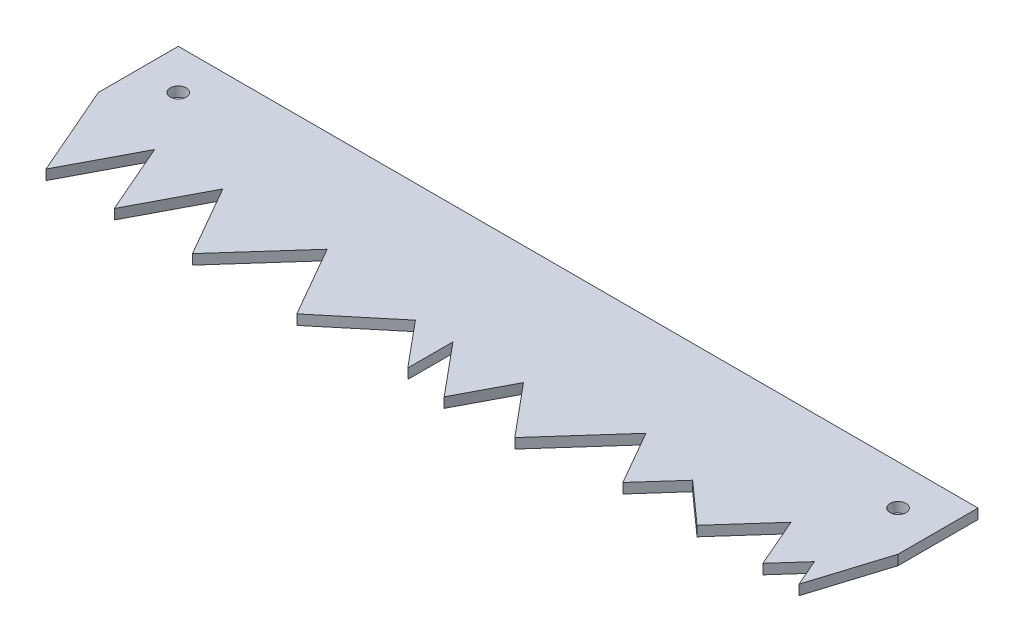
ISO-10303-21;
HEADER;
FILE_DESCRIPTION(('STEP AP214'),'2;1');
FILE_NAME('part.step','',(''),(''),'','','');
FILE_SCHEMA(('AUTOMOTIVE_DESIGN { 1 0 10303 214 1 1 1 1 }'));
ENDSEC;
DATA;
#1=APPLICATION_CONTEXT('core data for automotive mechanical design processes');
#2=APPLICATION_PROTOCOL_DEFINITION('international standard','automotive_design',2000,#1);
#3=PRODUCT_CONTEXT('',#1,'mechanical');
#4=PRODUCT('Part','Part','',(#3));
#5=PRODUCT_RELATED_PRODUCT_CATEGORY('part','',(#4));
#6=PRODUCT_DEFINITION_FORMATION('','',#4);
#7=PRODUCT_DEFINITION_CONTEXT('part definition',#1,'design');
#8=PRODUCT_DEFINITION('design','',#6,#7);
#9=PRODUCT_DEFINITION_SHAPE('','',#8);
#10=(LENGTH_UNIT() NAMED_UNIT(*) SI_UNIT(.MILLI.,.METRE.));
#11=(NAMED_UNIT(*) PLANE_ANGLE_UNIT() SI_UNIT($,.RADIAN.));
#12=(NAMED_UNIT(*) SI_UNIT($,.STERADIAN.) SOLID_ANGLE_UNIT());
#13=UNCERTAINTY_MEASURE_WITH_UNIT(LENGTH_MEASURE(1.E-05),#10,'distance_accuracy_value','');
#14=(GEOMETRIC_REPRESENTATION_CONTEXT(3) GLOBAL_UNCERTAINTY_ASSIGNED_CONTEXT((#13)) GLOBAL_UNIT_ASSIGNED_CONTEXT((#10,
#11,#12)) REPRESENTATION_CONTEXT('',''));
#15=CARTESIAN_POINT('',(0.,0.,0.));
#16=DIRECTION('',(0.,0.,1.));
#17=DIRECTION('',(1.,0.,0.));
#18=AXIS2_PLACEMENT_3D('',#15,#16,#17);
#19=CARTESIAN_POINT('',(-127.,3.175,-12.7));
#20=DIRECTION('',(1.,0.,0.));
#21=DIRECTION('',(0.,0.,-1.));
#22=AXIS2_PLACEMENT_3D('',#19,#20,#21);
#23=PLANE('',#22);
#24=DIRECTION('',(0.,0.,1.));
#25=VECTOR('',#24,1.);
#26=CARTESIAN_POINT('',(-127.,0.,-12.7));
#27=LINE('',#26,#25);
#28=CARTESIAN_POINT('',(-127.,0.,-12.7));
#29=VERTEX_POINT('',#28);
#30=CARTESIAN_POINT('',(-127.,0.,12.7));
#31=VERTEX_POINT('',#30);
#32=EDGE_CURVE('E211',#29,#31,#27,.T.);
#33=ORIENTED_EDGE('',*,*,#32,.T.);
#34=DIRECTION('',(0.,-1.,0.));
#35=VECTOR('',#34,1.);
#36=CARTESIAN_POINT('',(-127.,3.175,12.7));
#37=LINE('',#36,#35);
#38=CARTESIAN_POINT('',(-127.,3.175,12.7));
#39=VERTEX_POINT('',#38);
#40=EDGE_CURVE('E11',#39,#31,#37,.T.);
#41=ORIENTED_EDGE('',*,*,#40,.F.);
#42=DIRECTION('',(0.,0.,1.));
#43=VECTOR('',#42,1.);
#44=CARTESIAN_POINT('',(-127.,3.175,-12.7));
#45=LINE('',#44,#43);
#46=CARTESIAN_POINT('',(-127.,3.175,-12.7));
#47=VERTEX_POINT('',#46);
#48=EDGE_CURVE('E78',#47,#39,#45,.T.);
#49=ORIENTED_EDGE('',*,*,#48,.F.);
#50=DIRECTION('',(0.,-1.,0.));
#51=VECTOR('',#50,1.);
#52=CARTESIAN_POINT('',(-127.,3.175,-12.7));
#53=LINE('',#52,#51);
#54=EDGE_CURVE('E213',#47,#29,#53,.T.);
#55=ORIENTED_EDGE('',*,*,#54,.T.);
#56=EDGE_LOOP('',(#33,#41,#49,#55));
#57=FACE_BOUND('',#56,.T.);
#58=ADVANCED_FACE('F37',(#57),#23,.F.);
#59=CARTESIAN_POINT('',(127.,3.175,-12.7));
#60=DIRECTION('',(-1.,0.,0.));
#61=DIRECTION('',(0.,0.,1.));
#62=AXIS2_PLACEMENT_3D('',#59,#60,#61);
#63=PLANE('',#62);
#64=DIRECTION('',(0.,0.,-1.));
#65=VECTOR('',#64,1.);
#66=CARTESIAN_POINT('',(127.,0.,-12.7));
#67=LINE('',#66,#65);
#68=CARTESIAN_POINT('',(127.,0.,12.7));
#69=VERTEX_POINT('',#68);
#70=CARTESIAN_POINT('',(127.,0.,-12.7));
#71=VERTEX_POINT('',#70);
#72=EDGE_CURVE('E67',#69,#71,#67,.T.);
#73=ORIENTED_EDGE('',*,*,#72,.T.);
#74=DIRECTION('',(0.,-1.,0.));
#75=VECTOR('',#74,1.);
#76=CARTESIAN_POINT('',(127.,3.175,-12.7));
#77=LINE('',#76,#75);
#78=CARTESIAN_POINT('',(127.,3.175,-12.7));
#79=VERTEX_POINT('',#78);
#80=EDGE_CURVE('E407',#79,#71,#77,.T.);
#81=ORIENTED_EDGE('',*,*,#80,.F.);
#82=DIRECTION('',(0.,0.,-1.));
#83=VECTOR('',#82,1.);
#84=CARTESIAN_POINT('',(127.,3.175,-12.7));
#85=LINE('',#84,#83);
#86=CARTESIAN_POINT('',(127.,3.175,12.7));
#87=VERTEX_POINT('',#86);
#88=EDGE_CURVE('E401',#87,#79,#85,.T.);
#89=ORIENTED_EDGE('',*,*,#88,.F.);
#90=DIRECTION('',(0.,-1.,0.));
#91=VECTOR('',#90,1.);
#92=CARTESIAN_POINT('',(127.,3.175,12.7));
#93=LINE('',#92,#91);
#94=EDGE_CURVE('E45',#87,#69,#93,.T.);
#95=ORIENTED_EDGE('',*,*,#94,.T.);
#96=EDGE_LOOP('',(#73,#81,#89,#95));
#97=FACE_BOUND('',#96,.T.);
#98=ADVANCED_FACE('F409',(#97),#63,.F.);
#99=CARTESIAN_POINT('',(-127.,3.175,-12.7));
#100=DIRECTION('',(0.,0.,1.));
#101=DIRECTION('',(1.,0.,0.));
#102=AXIS2_PLACEMENT_3D('',#99,#100,#101);
#103=PLANE('',#102);
#104=DIRECTION('',(-1.,0.,0.));
#105=VECTOR('',#104,1.);
#106=CARTESIAN_POINT('',(-127.,0.,-12.7));
#107=LINE('',#106,#105);
#108=EDGE_CURVE('E73',#71,#29,#107,.T.);
#109=ORIENTED_EDGE('',*,*,#108,.T.);
#110=ORIENTED_EDGE('',*,*,#54,.F.);
#111=DIRECTION('',(-1.,0.,0.));
#112=VECTOR('',#111,1.);
#113=CARTESIAN_POINT('',(-127.,3.175,-12.7));
#114=LINE('',#113,#112);
#115=EDGE_CURVE('E53',#79,#47,#114,.T.);
#116=ORIENTED_EDGE('',*,*,#115,.F.);
#117=ORIENTED_EDGE('',*,*,#80,.T.);
#118=EDGE_LOOP('',(#109,#110,#116,#117));
#119=FACE_BOUND('',#118,.T.);
#120=ADVANCED_FACE('F494',(#119),#103,.F.);
#121=CARTESIAN_POINT('',(0.,3.175,0.));
#122=DIRECTION('',(0.,1.,0.));
#123=DIRECTION('',(0.,0.,1.));
#124=AXIS2_PLACEMENT_3D('',#121,#122,#123);
#125=PLANE('',#124);
#126=CARTESIAN_POINT('',(-114.3,3.175,0.));
#127=DIRECTION('',(0.,1.,0.));
#128=DIRECTION('',(0.,0.,1.));
#129=AXIS2_PLACEMENT_3D('',#126,#127,#128);
#130=CIRCLE('',#129,2.54);
#131=CARTESIAN_POINT('',(-114.3,3.175,2.54));
#132=VERTEX_POINT('',#131);
#133=EDGE_CURVE('E800',#132,#132,#130,.T.);
#134=ORIENTED_EDGE('',*,*,#133,.F.);
#135=EDGE_LOOP('',(#134));
#136=FACE_BOUND('',#135,.T.);
#137=CARTESIAN_POINT('',(114.3,3.175,0.));
#138=DIRECTION('',(0.,1.,0.));
#139=DIRECTION('',(0.,0.,1.));
#140=AXIS2_PLACEMENT_3D('',#137,#138,#139);
#141=CIRCLE('',#140,2.54);
#142=CARTESIAN_POINT('',(114.3,3.175,2.54));
#143=VERTEX_POINT('',#142);
#144=EDGE_CURVE('E801',#143,#143,#141,.T.);
#145=ORIENTED_EDGE('',*,*,#144,.F.);
#146=EDGE_LOOP('',(#145));
#147=FACE_BOUND('',#146,.T.);
#148=ORIENTED_EDGE('',*,*,#48,.T.);
#149=DIRECTION('',(0.398315927740006,0.,0.917248287928966));
#150=VECTOR('',#149,1.);
#151=CARTESIAN_POINT('',(-127.,3.175,12.7));
#152=LINE('',#151,#150);
#153=CARTESIAN_POINT('',(-114.245058960455,3.175,42.072282192024));
#154=VERTEX_POINT('',#153);
#155=EDGE_CURVE('E222',#39,#154,#152,.T.);
#156=ORIENTED_EDGE('',*,*,#155,.T.);
#157=DIRECTION('',(0.464759216041281,0.,-0.885437107368273));
#158=VECTOR('',#157,1.);
#159=CARTESIAN_POINT('',(-114.245058960455,3.175,42.072282192024));
#160=LINE('',#159,#158);
#161=CARTESIAN_POINT('',(-102.377802861673,3.175,19.4633514816094));
#162=VERTEX_POINT('',#161);
#163=EDGE_CURVE('E300',#154,#162,#160,.T.);
#164=ORIENTED_EDGE('',*,*,#163,.T.);
#165=DIRECTION('',(0.398315927740006,0.,0.917248287928965));
#166=VECTOR('',#165,1.);
#167=CARTESIAN_POINT('',(-102.377802861673,3.175,19.4633514816094));
#168=LINE('',#167,#166);
#169=CARTESIAN_POINT('',(-92.5598535347124,3.175,42.072282192024));
#170=VERTEX_POINT('',#169);
#171=EDGE_CURVE('E304',#162,#170,#168,.T.);
#172=ORIENTED_EDGE('',*,*,#171,.T.);
#173=DIRECTION('',(0.464759216041281,0.,-0.885437107368273));
#174=VECTOR('',#173,1.);
#175=CARTESIAN_POINT('',(-92.5598535347124,3.175,42.072282192024));
#176=LINE('',#175,#174);
#177=CARTESIAN_POINT('',(-80.6925974359306,3.175,19.4633514816094));
#178=VERTEX_POINT('',#177);
#179=EDGE_CURVE('E307',#170,#178,#176,.T.);
#180=ORIENTED_EDGE('',*,*,#179,.T.);
#181=DIRECTION('',(0.497500509024724,0.,0.867463684265883));
#182=VECTOR('',#181,1.);
#183=CARTESIAN_POINT('',(-80.6925974359306,3.175,19.4633514816094));
#184=LINE('',#183,#182);
#185=CARTESIAN_POINT('',(-67.7261127969167,3.175,42.072282192024));
#186=VERTEX_POINT('',#185);
#187=EDGE_CURVE('E310',#178,#186,#184,.T.);
#188=ORIENTED_EDGE('',*,*,#187,.T.);
#189=DIRECTION('',(0.665914196239404,0.,-0.74602833943948));
#190=VECTOR('',#189,1.);
#191=CARTESIAN_POINT('',(-67.7261127969167,3.175,42.072282192024));
#192=LINE('',#191,#190);
#193=CARTESIAN_POINT('',(-47.5450993877344,3.175,19.4633514816094));
#194=VERTEX_POINT('',#193);
#195=EDGE_CURVE('E313',#186,#194,#192,.T.);
#196=ORIENTED_EDGE('',*,*,#195,.T.);
#197=DIRECTION('',(0.497500509024724,0.,0.867463684265883));
#198=VECTOR('',#197,1.);
#199=CARTESIAN_POINT('',(-47.5450993877344,3.175,19.4633514816094));
#200=LINE('',#199,#198);
#201=CARTESIAN_POINT('',(-34.5786147487205,3.175,42.072282192024));
#202=VERTEX_POINT('',#201);
#203=EDGE_CURVE('E316',#194,#202,#200,.T.);
#204=ORIENTED_EDGE('',*,*,#203,.T.);
#205=DIRECTION('',(0.768703195752917,0.,-0.63960565729147));
#206=VECTOR('',#205,1.);
#207=CARTESIAN_POINT('',(-34.5786147487205,3.175,42.072282192024));
#208=LINE('',#207,#206);
#209=CARTESIAN_POINT('',(-14.024094064008,3.175,24.9697284554289));
#210=VERTEX_POINT('',#209);
#211=EDGE_CURVE('E319',#202,#210,#208,.T.);
#212=ORIENTED_EDGE('',*,*,#211,.T.);
#213=DIRECTION('',(0.639605657291469,0.,0.768703195752917));
#214=VECTOR('',#213,1.);
#215=CARTESIAN_POINT('',(-14.024094064008,3.175,24.9697284554289));
#216=LINE('',#215,#214);
#217=CARTESIAN_POINT('',(-2.09137630535577,3.175,39.3109372463847));
#218=VERTEX_POINT('',#217);
#219=EDGE_CURVE('E322',#210,#218,#216,.T.);
#220=ORIENTED_EDGE('',*,*,#219,.T.);
#221=DIRECTION('',(0.,0.,-1.));
#222=VECTOR('',#221,1.);
#223=CARTESIAN_POINT('',(-2.09137630535577,3.175,39.3109372463847));
#224=LINE('',#223,#222);
#225=CARTESIAN_POINT('',(-2.09137630535577,3.175,24.9697284554289));
#226=VERTEX_POINT('',#225);
#227=EDGE_CURVE('E325',#218,#226,#224,.T.);
#228=ORIENTED_EDGE('',*,*,#227,.T.);
#229=DIRECTION('',(0.639605657291469,0.,0.768703195752917));
#230=VECTOR('',#229,1.);
#231=CARTESIAN_POINT('',(-2.09137630535577,3.175,24.9697284554289));
#232=LINE('',#231,#230);
#233=CARTESIAN_POINT('',(11.6494776968979,3.175,41.4840263880584));
#234=VERTEX_POINT('',#233);
#235=EDGE_CURVE('E328',#226,#234,#232,.T.);
#236=ORIENTED_EDGE('',*,*,#235,.T.);
#237=DIRECTION('',(0.464759216041281,0.,-0.885437107368273));
#238=VECTOR('',#237,1.);
#239=CARTESIAN_POINT('',(11.6494776968979,3.175,41.4840263880584));
#240=LINE('',#239,#238);
#241=CARTESIAN_POINT('',(20.3177073167897,3.175,24.9697284554289));
#242=VERTEX_POINT('',#241);
#243=EDGE_CURVE('E331',#234,#242,#240,.T.);
#244=ORIENTED_EDGE('',*,*,#243,.T.);
#245=DIRECTION('',(0.639605657291469,0.,0.768703195752917));
#246=VECTOR('',#245,1.);
#247=CARTESIAN_POINT('',(20.3177073167897,3.175,24.9697284554289));
#248=LINE('',#247,#246);
#249=CARTESIAN_POINT('',(34.0585613190434,3.175,41.4840263880584));
#250=VERTEX_POINT('',#249);
#251=EDGE_CURVE('E334',#242,#250,#248,.T.);
#252=ORIENTED_EDGE('',*,*,#251,.T.);
#253=DIRECTION('',(0.665914196239404,0.,-0.74602833943948));
#254=VECTOR('',#253,1.);
#255=CARTESIAN_POINT('',(34.0585613190434,3.175,41.4840263880584));
#256=LINE('',#255,#254);
#257=CARTESIAN_POINT('',(53.7144902640413,3.175,19.4633514816094));
#258=VERTEX_POINT('',#257);
#259=EDGE_CURVE('E337',#250,#258,#256,.T.);
#260=ORIENTED_EDGE('',*,*,#259,.T.);
#261=DIRECTION('',(0.497500509024724,0.,0.867463684265883));
#262=VECTOR('',#261,1.);
#263=CARTESIAN_POINT('',(53.7144902640413,3.175,19.4633514816094));
#264=LINE('',#263,#262);
#265=CARTESIAN_POINT('',(63.5835684459839,3.175,36.6715085884204));
#266=VERTEX_POINT('',#265);
#267=EDGE_CURVE('E340',#258,#266,#264,.T.);
#268=ORIENTED_EDGE('',*,*,#267,.T.);
#269=DIRECTION('',(0.665914196239404,0.,-0.74602833943948));
#270=VECTOR('',#269,1.);
#271=CARTESIAN_POINT('',(63.5835684459839,3.175,36.6715085884204));
#272=LINE('',#271,#270);
#273=CARTESIAN_POINT('',(74.0287232743996,3.175,24.9697284554289));
#274=VERTEX_POINT('',#273);
#275=EDGE_CURVE('E343',#266,#274,#272,.T.);
#276=ORIENTED_EDGE('',*,*,#275,.T.);
#277=DIRECTION('',(0.74602833943948,0.,0.665914196239404));
#278=VECTOR('',#277,1.);
#279=CARTESIAN_POINT('',(74.0287232743996,3.175,24.9697284554289));
#280=LINE('',#279,#278);
#281=CARTESIAN_POINT('',(87.1383095400198,3.175,36.6715085884204));
#282=VERTEX_POINT('',#281);
#283=EDGE_CURVE('E346',#274,#282,#280,.T.);
#284=ORIENTED_EDGE('',*,*,#283,.T.);
#285=DIRECTION('',(0.665914196239404,0.,-0.746028339439481));
#286=VECTOR('',#285,1.);
#287=CARTESIAN_POINT('',(87.1383095400198,3.175,36.6715085884204));
#288=LINE('',#287,#286);
#289=CARTESIAN_POINT('',(101.210719192239,3.175,20.9060894637878));
#290=VERTEX_POINT('',#289);
#291=EDGE_CURVE('E349',#282,#290,#288,.T.);
#292=ORIENTED_EDGE('',*,*,#291,.T.);
#293=DIRECTION('',(0.398315927740006,0.,0.917248287928966));
#294=VECTOR('',#293,1.);
#295=CARTESIAN_POINT('',(101.210719192239,3.175,20.9060894637878));
#296=LINE('',#295,#294);
#297=CARTESIAN_POINT('',(108.056867206335,3.175,36.6715085884204));
#298=VERTEX_POINT('',#297);
#299=EDGE_CURVE('E352',#290,#298,#296,.T.);
#300=ORIENTED_EDGE('',*,*,#299,.T.);
#301=DIRECTION('',(0.665914196239403,0.,-0.746028339439481));
#302=VECTOR('',#301,1.);
#303=CARTESIAN_POINT('',(108.056867206335,3.175,36.6715085884204));
#304=LINE('',#303,#302);
#305=CARTESIAN_POINT('',(115.764667779559,3.175,28.0364056054141));
#306=VERTEX_POINT('',#305);
#307=EDGE_CURVE('E355',#298,#306,#304,.T.);
#308=ORIENTED_EDGE('',*,*,#307,.T.);
#309=DIRECTION('',(0.398315927740005,0.,0.917248287928966));
#310=VECTOR('',#309,1.);
#311=CARTESIAN_POINT('',(115.764667779559,3.175,28.0364056054141));
#312=LINE('',#311,#310);
#313=CARTESIAN_POINT('',(119.514469333915,3.175,36.6715085884204));
#314=VERTEX_POINT('',#313);
#315=EDGE_CURVE('E233',#306,#314,#312,.T.);
#316=ORIENTED_EDGE('',*,*,#315,.T.);
#317=DIRECTION('',(0.298073075971362,0.,-0.954543053707359));
#318=VECTOR('',#317,1.);
#319=CARTESIAN_POINT('',(119.514469333915,3.175,36.6715085884204));
#320=LINE('',#319,#318);
#321=EDGE_CURVE('E228',#314,#87,#320,.T.);
#322=ORIENTED_EDGE('',*,*,#321,.T.);
#323=ORIENTED_EDGE('',*,*,#88,.T.);
#324=ORIENTED_EDGE('',*,*,#115,.T.);
#325=EDGE_LOOP('',(#148,#156,#164,#172,#180,#188,#196,#204,#212,#220,#228,#236,#244,#252,#260,
#268,#276,#284,#292,#300,#308,#316,#322,#323,#324));
#326=FACE_BOUND('',#325,.T.);
#327=ADVANCED_FACE('F492',(#136,#147,#326),#125,.T.);
#328=CARTESIAN_POINT('',(0.,0.,0.));
#329=DIRECTION('',(0.,1.,0.));
#330=DIRECTION('',(0.,0.,1.));
#331=AXIS2_PLACEMENT_3D('',#328,#329,#330);
#332=PLANE('',#331);
#333=CARTESIAN_POINT('',(-114.3,0.,0.));
#334=DIRECTION('',(0.,1.,0.));
#335=DIRECTION('',(0.,0.,1.));
#336=AXIS2_PLACEMENT_3D('',#333,#334,#335);
#337=CIRCLE('',#336,2.54);
#338=CARTESIAN_POINT('',(-114.3,0.,2.54));
#339=VERTEX_POINT('',#338);
#340=EDGE_CURVE('E301',#339,#339,#337,.T.);
#341=ORIENTED_EDGE('',*,*,#340,.T.);
#342=EDGE_LOOP('',(#341));
#343=FACE_BOUND('',#342,.T.);
#344=CARTESIAN_POINT('',(114.3,0.,0.));
#345=DIRECTION('',(0.,1.,0.));
#346=DIRECTION('',(0.,0.,1.));
#347=AXIS2_PLACEMENT_3D('',#344,#345,#346);
#348=CIRCLE('',#347,2.54);
#349=CARTESIAN_POINT('',(114.3,0.,2.54));
#350=VERTEX_POINT('',#349);
#351=EDGE_CURVE('E236',#350,#350,#348,.T.);
#352=ORIENTED_EDGE('',*,*,#351,.T.);
#353=EDGE_LOOP('',(#352));
#354=FACE_BOUND('',#353,.T.);
#355=ORIENTED_EDGE('',*,*,#32,.F.);
#356=ORIENTED_EDGE('',*,*,#108,.F.);
#357=ORIENTED_EDGE('',*,*,#72,.F.);
#358=DIRECTION('',(0.298073075971362,0.,-0.954543053707359));
#359=VECTOR('',#358,1.);
#360=CARTESIAN_POINT('',(119.514469333915,0.,36.6715085884204));
#361=LINE('',#360,#359);
#362=CARTESIAN_POINT('',(119.514469333915,0.,36.6715085884204));
#363=VERTEX_POINT('',#362);
#364=EDGE_CURVE('E295',#363,#69,#361,.T.);
#365=ORIENTED_EDGE('',*,*,#364,.F.);
#366=DIRECTION('',(0.398315927740005,0.,0.917248287928966));
#367=VECTOR('',#366,1.);
#368=CARTESIAN_POINT('',(115.764667779559,0.,28.0364056054141));
#369=LINE('',#368,#367);
#370=CARTESIAN_POINT('',(115.764667779559,0.,28.0364056054141));
#371=VERTEX_POINT('',#370);
#372=EDGE_CURVE('E292',#371,#363,#369,.T.);
#373=ORIENTED_EDGE('',*,*,#372,.F.);
#374=DIRECTION('',(0.665914196239403,0.,-0.746028339439481));
#375=VECTOR('',#374,1.);
#376=CARTESIAN_POINT('',(108.056867206335,0.,36.6715085884204));
#377=LINE('',#376,#375);
#378=CARTESIAN_POINT('',(108.056867206335,0.,36.6715085884204));
#379=VERTEX_POINT('',#378);
#380=EDGE_CURVE('E289',#379,#371,#377,.T.);
#381=ORIENTED_EDGE('',*,*,#380,.F.);
#382=DIRECTION('',(0.398315927740006,0.,0.917248287928966));
#383=VECTOR('',#382,1.);
#384=CARTESIAN_POINT('',(101.210719192239,0.,20.9060894637878));
#385=LINE('',#384,#383);
#386=CARTESIAN_POINT('',(101.210719192239,0.,20.9060894637878));
#387=VERTEX_POINT('',#386);
#388=EDGE_CURVE('E286',#387,#379,#385,.T.);
#389=ORIENTED_EDGE('',*,*,#388,.F.);
#390=DIRECTION('',(0.665914196239404,0.,-0.746028339439481));
#391=VECTOR('',#390,1.);
#392=CARTESIAN_POINT('',(87.1383095400198,0.,36.6715085884204));
#393=LINE('',#392,#391);
#394=CARTESIAN_POINT('',(87.1383095400198,0.,36.6715085884204));
#395=VERTEX_POINT('',#394);
#396=EDGE_CURVE('E283',#395,#387,#393,.T.);
#397=ORIENTED_EDGE('',*,*,#396,.F.);
#398=DIRECTION('',(0.74602833943948,0.,0.665914196239404));
#399=VECTOR('',#398,1.);
#400=CARTESIAN_POINT('',(74.0287232743996,0.,24.9697284554289));
#401=LINE('',#400,#399);
#402=CARTESIAN_POINT('',(74.0287232743996,0.,24.9697284554289));
#403=VERTEX_POINT('',#402);
#404=EDGE_CURVE('E280',#403,#395,#401,.T.);
#405=ORIENTED_EDGE('',*,*,#404,.F.);
#406=DIRECTION('',(0.665914196239404,0.,-0.74602833943948));
#407=VECTOR('',#406,1.);
#408=CARTESIAN_POINT('',(63.5835684459839,0.,36.6715085884204));
#409=LINE('',#408,#407);
#410=CARTESIAN_POINT('',(63.5835684459839,0.,36.6715085884204));
#411=VERTEX_POINT('',#410);
#412=EDGE_CURVE('E277',#411,#403,#409,.T.);
#413=ORIENTED_EDGE('',*,*,#412,.F.);
#414=DIRECTION('',(0.497500509024724,0.,0.867463684265883));
#415=VECTOR('',#414,1.);
#416=CARTESIAN_POINT('',(53.7144902640413,0.,19.4633514816094));
#417=LINE('',#416,#415);
#418=CARTESIAN_POINT('',(53.7144902640413,0.,19.4633514816094));
#419=VERTEX_POINT('',#418);
#420=EDGE_CURVE('E274',#419,#411,#417,.T.);
#421=ORIENTED_EDGE('',*,*,#420,.F.);
#422=DIRECTION('',(0.665914196239404,0.,-0.74602833943948));
#423=VECTOR('',#422,1.);
#424=CARTESIAN_POINT('',(34.0585613190434,0.,41.4840263880584));
#425=LINE('',#424,#423);
#426=CARTESIAN_POINT('',(34.0585613190434,0.,41.4840263880584));
#427=VERTEX_POINT('',#426);
#428=EDGE_CURVE('E271',#427,#419,#425,.T.);
#429=ORIENTED_EDGE('',*,*,#428,.F.);
#430=DIRECTION('',(0.639605657291469,0.,0.768703195752917));
#431=VECTOR('',#430,1.);
#432=CARTESIAN_POINT('',(20.3177073167897,0.,24.9697284554289));
#433=LINE('',#432,#431);
#434=CARTESIAN_POINT('',(20.3177073167897,0.,24.9697284554289));
#435=VERTEX_POINT('',#434);
#436=EDGE_CURVE('E268',#435,#427,#433,.T.);
#437=ORIENTED_EDGE('',*,*,#436,.F.);
#438=DIRECTION('',(0.464759216041281,0.,-0.885437107368273));
#439=VECTOR('',#438,1.);
#440=CARTESIAN_POINT('',(11.6494776968979,0.,41.4840263880584));
#441=LINE('',#440,#439);
#442=CARTESIAN_POINT('',(11.6494776968979,0.,41.4840263880584));
#443=VERTEX_POINT('',#442);
#444=EDGE_CURVE('E265',#443,#435,#441,.T.);
#445=ORIENTED_EDGE('',*,*,#444,.F.);
#446=DIRECTION('',(0.639605657291469,0.,0.768703195752917));
#447=VECTOR('',#446,1.);
#448=CARTESIAN_POINT('',(-2.09137630535577,0.,24.9697284554289));
#449=LINE('',#448,#447);
#450=CARTESIAN_POINT('',(-2.09137630535577,0.,24.9697284554289));
#451=VERTEX_POINT('',#450);
#452=EDGE_CURVE('E262',#451,#443,#449,.T.);
#453=ORIENTED_EDGE('',*,*,#452,.F.);
#454=DIRECTION('',(0.,0.,-1.));
#455=VECTOR('',#454,1.);
#456=CARTESIAN_POINT('',(-2.09137630535577,0.,39.3109372463847));
#457=LINE('',#456,#455);
#458=CARTESIAN_POINT('',(-2.09137630535577,0.,39.3109372463847));
#459=VERTEX_POINT('',#458);
#460=EDGE_CURVE('E259',#459,#451,#457,.T.);
#461=ORIENTED_EDGE('',*,*,#460,.F.);
#462=DIRECTION('',(0.639605657291469,0.,0.768703195752917));
#463=VECTOR('',#462,1.);
#464=CARTESIAN_POINT('',(-14.024094064008,0.,24.9697284554289));
#465=LINE('',#464,#463);
#466=CARTESIAN_POINT('',(-14.024094064008,0.,24.9697284554289));
#467=VERTEX_POINT('',#466);
#468=EDGE_CURVE('E256',#467,#459,#465,.T.);
#469=ORIENTED_EDGE('',*,*,#468,.F.);
#470=DIRECTION('',(0.768703195752917,0.,-0.63960565729147));
#471=VECTOR('',#470,1.);
#472=CARTESIAN_POINT('',(-34.5786147487205,0.,42.072282192024));
#473=LINE('',#472,#471);
#474=CARTESIAN_POINT('',(-34.5786147487205,0.,42.072282192024));
#475=VERTEX_POINT('',#474);
#476=EDGE_CURVE('E253',#475,#467,#473,.T.);
#477=ORIENTED_EDGE('',*,*,#476,.F.);
#478=DIRECTION('',(0.497500509024724,0.,0.867463684265883));
#479=VECTOR('',#478,1.);
#480=CARTESIAN_POINT('',(-47.5450993877344,0.,19.4633514816094));
#481=LINE('',#480,#479);
#482=CARTESIAN_POINT('',(-47.5450993877344,0.,19.4633514816094));
#483=VERTEX_POINT('',#482);
#484=EDGE_CURVE('E250',#483,#475,#481,.T.);
#485=ORIENTED_EDGE('',*,*,#484,.F.);
#486=DIRECTION('',(0.665914196239404,0.,-0.74602833943948));
#487=VECTOR('',#486,1.);
#488=CARTESIAN_POINT('',(-67.7261127969167,0.,42.072282192024));
#489=LINE('',#488,#487);
#490=CARTESIAN_POINT('',(-67.7261127969167,0.,42.072282192024));
#491=VERTEX_POINT('',#490);
#492=EDGE_CURVE('E247',#491,#483,#489,.T.);
#493=ORIENTED_EDGE('',*,*,#492,.F.);
#494=DIRECTION('',(0.497500509024724,0.,0.867463684265883));
#495=VECTOR('',#494,1.);
#496=CARTESIAN_POINT('',(-80.6925974359306,0.,19.4633514816094));
#497=LINE('',#496,#495);
#498=CARTESIAN_POINT('',(-80.6925974359306,0.,19.4633514816094));
#499=VERTEX_POINT('',#498);
#500=EDGE_CURVE('E244',#499,#491,#497,.T.);
#501=ORIENTED_EDGE('',*,*,#500,.F.);
#502=DIRECTION('',(0.464759216041281,0.,-0.885437107368273));
#503=VECTOR('',#502,1.);
#504=CARTESIAN_POINT('',(-92.5598535347124,0.,42.072282192024));
#505=LINE('',#504,#503);
#506=CARTESIAN_POINT('',(-92.5598535347124,0.,42.072282192024));
#507=VERTEX_POINT('',#506);
#508=EDGE_CURVE('E241',#507,#499,#505,.T.);
#509=ORIENTED_EDGE('',*,*,#508,.F.);
#510=DIRECTION('',(0.398315927740006,0.,0.917248287928965));
#511=VECTOR('',#510,1.);
#512=CARTESIAN_POINT('',(-102.377802861673,0.,19.4633514816094));
#513=LINE('',#512,#511);
#514=CARTESIAN_POINT('',(-102.377802861673,0.,19.4633514816094));
#515=VERTEX_POINT('',#514);
#516=EDGE_CURVE('E230',#515,#507,#513,.T.);
#517=ORIENTED_EDGE('',*,*,#516,.F.);
#518=DIRECTION('',(0.464759216041281,0.,-0.885437107368273));
#519=VECTOR('',#518,1.);
#520=CARTESIAN_POINT('',(-114.245058960455,0.,42.072282192024));
#521=LINE('',#520,#519);
#522=CARTESIAN_POINT('',(-114.245058960455,0.,42.072282192024));
#523=VERTEX_POINT('',#522);
#524=EDGE_CURVE('E227',#523,#515,#521,.T.);
#525=ORIENTED_EDGE('',*,*,#524,.F.);
#526=DIRECTION('',(0.398315927740006,0.,0.917248287928966));
#527=VECTOR('',#526,1.);
#528=CARTESIAN_POINT('',(-127.,0.,12.7));
#529=LINE('',#528,#527);
#530=EDGE_CURVE('E221',#31,#523,#529,.T.);
#531=ORIENTED_EDGE('',*,*,#530,.F.);
#532=EDGE_LOOP('',(#355,#356,#357,#365,#373,#381,#389,#397,#405,#413,#421,#429,#437,#445,#453,
#461,#469,#477,#485,#493,#501,#509,#517,#525,#531));
#533=FACE_BOUND('',#532,.T.);
#534=ADVANCED_FACE('F224',(#343,#354,#533),#332,.F.);
#535=CARTESIAN_POINT('',(119.514469333915,0.,36.6715085884204));
#536=DIRECTION('',(0.954543053707359,0.,0.298073075971362));
#537=DIRECTION('',(0.298073075971362,0.,-0.954543053707359));
#538=AXIS2_PLACEMENT_3D('',#535,#536,#537);
#539=PLANE('',#538);
#540=ORIENTED_EDGE('',*,*,#321,.F.);
#541=DIRECTION('',(0.,1.,0.));
#542=VECTOR('',#541,1.);
#543=CARTESIAN_POINT('',(119.514469333915,0.,36.6715085884204));
#544=LINE('',#543,#542);
#545=EDGE_CURVE('E216',#363,#314,#544,.T.);
#546=ORIENTED_EDGE('',*,*,#545,.F.);
#547=ORIENTED_EDGE('',*,*,#364,.T.);
#548=ORIENTED_EDGE('',*,*,#94,.F.);
#549=EDGE_LOOP('',(#540,#546,#547,#548));
#550=FACE_BOUND('',#549,.T.);
#551=ADVANCED_FACE('F414',(#550),#539,.T.);
#552=CARTESIAN_POINT('',(115.764667779559,0.,28.0364056054141));
#553=DIRECTION('',(-0.917248287928966,0.,0.398315927740006));
#554=DIRECTION('',(0.398315927740006,0.,0.917248287928966));
#555=AXIS2_PLACEMENT_3D('',#552,#553,#554);
#556=PLANE('',#555);
#557=ORIENTED_EDGE('',*,*,#315,.F.);
#558=DIRECTION('',(0.,1.,0.));
#559=VECTOR('',#558,1.);
#560=CARTESIAN_POINT('',(115.764667779559,0.,28.0364056054141));
#561=LINE('',#560,#559);
#562=EDGE_CURVE('E361',#371,#306,#561,.T.);
#563=ORIENTED_EDGE('',*,*,#562,.F.);
#564=ORIENTED_EDGE('',*,*,#372,.T.);
#565=ORIENTED_EDGE('',*,*,#545,.T.);
#566=EDGE_LOOP('',(#557,#563,#564,#565));
#567=FACE_BOUND('',#566,.T.);
#568=ADVANCED_FACE('F417',(#567),#556,.T.);
#569=CARTESIAN_POINT('',(108.056867206335,0.,36.6715085884204));
#570=DIRECTION('',(0.746028339439481,0.,0.665914196239403));
#571=DIRECTION('',(0.665914196239403,0.,-0.746028339439481));
#572=AXIS2_PLACEMENT_3D('',#569,#570,#571);
#573=PLANE('',#572);
#574=ORIENTED_EDGE('',*,*,#307,.F.);
#575=DIRECTION('',(0.,1.,0.));
#576=VECTOR('',#575,1.);
#577=CARTESIAN_POINT('',(108.056867206335,0.,36.6715085884204));
#578=LINE('',#577,#576);
#579=EDGE_CURVE('E363',#379,#298,#578,.T.);
#580=ORIENTED_EDGE('',*,*,#579,.F.);
#581=ORIENTED_EDGE('',*,*,#380,.T.);
#582=ORIENTED_EDGE('',*,*,#562,.T.);
#583=EDGE_LOOP('',(#574,#580,#581,#582));
#584=FACE_BOUND('',#583,.T.);
#585=ADVANCED_FACE('F422',(#584),#573,.T.);
#586=CARTESIAN_POINT('',(101.210719192239,0.,20.9060894637878));
#587=DIRECTION('',(-0.917248287928965,0.,0.398315927740006));
#588=DIRECTION('',(0.398315927740006,0.,0.917248287928965));
#589=AXIS2_PLACEMENT_3D('',#586,#587,#588);
#590=PLANE('',#589);
#591=ORIENTED_EDGE('',*,*,#299,.F.);
#592=DIRECTION('',(0.,1.,0.));
#593=VECTOR('',#592,1.);
#594=CARTESIAN_POINT('',(101.210719192239,0.,20.9060894637878));
#595=LINE('',#594,#593);
#596=EDGE_CURVE('E365',#387,#290,#595,.T.);
#597=ORIENTED_EDGE('',*,*,#596,.F.);
#598=ORIENTED_EDGE('',*,*,#388,.T.);
#599=ORIENTED_EDGE('',*,*,#579,.T.);
#600=EDGE_LOOP('',(#591,#597,#598,#599));
#601=FACE_BOUND('',#600,.T.);
#602=ADVANCED_FACE('F425',(#601),#590,.T.);
#603=CARTESIAN_POINT('',(87.1383095400198,0.,36.6715085884204));
#604=DIRECTION('',(0.746028339439481,0.,0.665914196239404));
#605=DIRECTION('',(0.665914196239404,0.,-0.746028339439481));
#606=AXIS2_PLACEMENT_3D('',#603,#604,#605);
#607=PLANE('',#606);
#608=ORIENTED_EDGE('',*,*,#291,.F.);
#609=DIRECTION('',(0.,1.,0.));
#610=VECTOR('',#609,1.);
#611=CARTESIAN_POINT('',(87.1383095400198,0.,36.6715085884204));
#612=LINE('',#611,#610);
#613=EDGE_CURVE('E367',#395,#282,#612,.T.);
#614=ORIENTED_EDGE('',*,*,#613,.F.);
#615=ORIENTED_EDGE('',*,*,#396,.T.);
#616=ORIENTED_EDGE('',*,*,#596,.T.);
#617=EDGE_LOOP('',(#608,#614,#615,#616));
#618=FACE_BOUND('',#617,.T.);
#619=ADVANCED_FACE('F430',(#618),#607,.T.);
#620=CARTESIAN_POINT('',(74.0287232743996,0.,24.9697284554289));
#621=DIRECTION('',(-0.665914196239404,0.,0.74602833943948));
#622=DIRECTION('',(0.74602833943948,0.,0.665914196239404));
#623=AXIS2_PLACEMENT_3D('',#620,#621,#622);
#624=PLANE('',#623);
#625=ORIENTED_EDGE('',*,*,#283,.F.);
#626=DIRECTION('',(0.,1.,0.));
#627=VECTOR('',#626,1.);
#628=CARTESIAN_POINT('',(74.0287232743996,0.,24.9697284554289));
#629=LINE('',#628,#627);
#630=EDGE_CURVE('E369',#403,#274,#629,.T.);
#631=ORIENTED_EDGE('',*,*,#630,.F.);
#632=ORIENTED_EDGE('',*,*,#404,.T.);
#633=ORIENTED_EDGE('',*,*,#613,.T.);
#634=EDGE_LOOP('',(#625,#631,#632,#633));
#635=FACE_BOUND('',#634,.T.);
#636=ADVANCED_FACE('F433',(#635),#624,.T.);
#637=CARTESIAN_POINT('',(63.5835684459839,0.,36.6715085884204));
#638=DIRECTION('',(0.74602833943948,0.,0.665914196239404));
#639=DIRECTION('',(0.665914196239404,0.,-0.74602833943948));
#640=AXIS2_PLACEMENT_3D('',#637,#638,#639);
#641=PLANE('',#640);
#642=ORIENTED_EDGE('',*,*,#275,.F.);
#643=DIRECTION('',(0.,1.,0.));
#644=VECTOR('',#643,1.);
#645=CARTESIAN_POINT('',(63.5835684459839,0.,36.6715085884204));
#646=LINE('',#645,#644);
#647=EDGE_CURVE('E371',#411,#266,#646,.T.);
#648=ORIENTED_EDGE('',*,*,#647,.F.);
#649=ORIENTED_EDGE('',*,*,#412,.T.);
#650=ORIENTED_EDGE('',*,*,#630,.T.);
#651=EDGE_LOOP('',(#642,#648,#649,#650));
#652=FACE_BOUND('',#651,.T.);
#653=ADVANCED_FACE('F438',(#652),#641,.T.);
#654=CARTESIAN_POINT('',(53.7144902640413,0.,19.4633514816094));
#655=DIRECTION('',(-0.867463684265883,0.,0.497500509024724));
#656=DIRECTION('',(0.497500509024724,0.,0.867463684265883));
#657=AXIS2_PLACEMENT_3D('',#654,#655,#656);
#658=PLANE('',#657);
#659=ORIENTED_EDGE('',*,*,#267,.F.);
#660=DIRECTION('',(0.,1.,0.));
#661=VECTOR('',#660,1.);
#662=CARTESIAN_POINT('',(53.7144902640413,0.,19.4633514816094));
#663=LINE('',#662,#661);
#664=EDGE_CURVE('E373',#419,#258,#663,.T.);
#665=ORIENTED_EDGE('',*,*,#664,.F.);
#666=ORIENTED_EDGE('',*,*,#420,.T.);
#667=ORIENTED_EDGE('',*,*,#647,.T.);
#668=EDGE_LOOP('',(#659,#665,#666,#667));
#669=FACE_BOUND('',#668,.T.);
#670=ADVANCED_FACE('F441',(#669),#658,.T.);
#671=CARTESIAN_POINT('',(34.0585613190434,0.,41.4840263880584));
#672=DIRECTION('',(0.74602833943948,0.,0.665914196239404));
#673=DIRECTION('',(0.665914196239404,0.,-0.74602833943948));
#674=AXIS2_PLACEMENT_3D('',#671,#672,#673);
#675=PLANE('',#674);
#676=ORIENTED_EDGE('',*,*,#259,.F.);
#677=DIRECTION('',(0.,1.,0.));
#678=VECTOR('',#677,1.);
#679=CARTESIAN_POINT('',(34.0585613190434,0.,41.4840263880584));
#680=LINE('',#679,#678);
#681=EDGE_CURVE('E375',#427,#250,#680,.T.);
#682=ORIENTED_EDGE('',*,*,#681,.F.);
#683=ORIENTED_EDGE('',*,*,#428,.T.);
#684=ORIENTED_EDGE('',*,*,#664,.T.);
#685=EDGE_LOOP('',(#676,#682,#683,#684));
#686=FACE_BOUND('',#685,.T.);
#687=ADVANCED_FACE('F446',(#686),#675,.T.);
#688=CARTESIAN_POINT('',(20.3177073167897,0.,24.9697284554289));
#689=DIRECTION('',(-0.768703195752917,0.,0.639605657291469));
#690=DIRECTION('',(0.639605657291469,0.,0.768703195752917));
#691=AXIS2_PLACEMENT_3D('',#688,#689,#690);
#692=PLANE('',#691);
#693=ORIENTED_EDGE('',*,*,#251,.F.);
#694=DIRECTION('',(0.,1.,0.));
#695=VECTOR('',#694,1.);
#696=CARTESIAN_POINT('',(20.3177073167897,0.,24.9697284554289));
#697=LINE('',#696,#695);
#698=EDGE_CURVE('E377',#435,#242,#697,.T.);
#699=ORIENTED_EDGE('',*,*,#698,.F.);
#700=ORIENTED_EDGE('',*,*,#436,.T.);
#701=ORIENTED_EDGE('',*,*,#681,.T.);
#702=EDGE_LOOP('',(#693,#699,#700,#701));
#703=FACE_BOUND('',#702,.T.);
#704=ADVANCED_FACE('F449',(#703),#692,.T.);
#705=CARTESIAN_POINT('',(11.6494776968979,0.,41.4840263880584));
#706=DIRECTION('',(0.885437107368273,0.,0.464759216041281));
#707=DIRECTION('',(0.464759216041281,0.,-0.885437107368273));
#708=AXIS2_PLACEMENT_3D('',#705,#706,#707);
#709=PLANE('',#708);
#710=ORIENTED_EDGE('',*,*,#243,.F.);
#711=DIRECTION('',(0.,1.,0.));
#712=VECTOR('',#711,1.);
#713=CARTESIAN_POINT('',(11.6494776968979,0.,41.4840263880584));
#714=LINE('',#713,#712);
#715=EDGE_CURVE('E379',#443,#234,#714,.T.);
#716=ORIENTED_EDGE('',*,*,#715,.F.);
#717=ORIENTED_EDGE('',*,*,#444,.T.);
#718=ORIENTED_EDGE('',*,*,#698,.T.);
#719=EDGE_LOOP('',(#710,#716,#717,#718));
#720=FACE_BOUND('',#719,.T.);
#721=ADVANCED_FACE('F454',(#720),#709,.T.);
#722=CARTESIAN_POINT('',(-2.09137630535577,0.,24.9697284554289));
#723=DIRECTION('',(-0.768703195752917,0.,0.639605657291469));
#724=DIRECTION('',(0.639605657291469,0.,0.768703195752917));
#725=AXIS2_PLACEMENT_3D('',#722,#723,#724);
#726=PLANE('',#725);
#727=ORIENTED_EDGE('',*,*,#235,.F.);
#728=DIRECTION('',(0.,1.,0.));
#729=VECTOR('',#728,1.);
#730=CARTESIAN_POINT('',(-2.09137630535577,0.,24.9697284554289));
#731=LINE('',#730,#729);
#732=EDGE_CURVE('E381',#451,#226,#731,.T.);
#733=ORIENTED_EDGE('',*,*,#732,.F.);
#734=ORIENTED_EDGE('',*,*,#452,.T.);
#735=ORIENTED_EDGE('',*,*,#715,.T.);
#736=EDGE_LOOP('',(#727,#733,#734,#735));
#737=FACE_BOUND('',#736,.T.);
#738=ADVANCED_FACE('F457',(#737),#726,.T.);
#739=CARTESIAN_POINT('',(-2.09137630535577,0.,39.3109372463847));
#740=DIRECTION('',(1.,0.,0.));
#741=DIRECTION('',(0.,0.,-1.));
#742=AXIS2_PLACEMENT_3D('',#739,#740,#741);
#743=PLANE('',#742);
#744=ORIENTED_EDGE('',*,*,#227,.F.);
#745=DIRECTION('',(0.,1.,0.));
#746=VECTOR('',#745,1.);
#747=CARTESIAN_POINT('',(-2.09137630535577,0.,39.3109372463847));
#748=LINE('',#747,#746);
#749=EDGE_CURVE('E383',#459,#218,#748,.T.);
#750=ORIENTED_EDGE('',*,*,#749,.F.);
#751=ORIENTED_EDGE('',*,*,#460,.T.);
#752=ORIENTED_EDGE('',*,*,#732,.T.);
#753=EDGE_LOOP('',(#744,#750,#751,#752));
#754=FACE_BOUND('',#753,.T.);
#755=ADVANCED_FACE('F462',(#754),#743,.T.);
#756=CARTESIAN_POINT('',(-14.024094064008,0.,24.9697284554289));
#757=DIRECTION('',(-0.768703195752917,0.,0.639605657291469));
#758=DIRECTION('',(0.63960565729147,0.,0.768703195752917));
#759=AXIS2_PLACEMENT_3D('',#756,#757,#758);
#760=PLANE('',#759);
#761=ORIENTED_EDGE('',*,*,#219,.F.);
#762=DIRECTION('',(0.,1.,0.));
#763=VECTOR('',#762,1.);
#764=CARTESIAN_POINT('',(-14.024094064008,0.,24.9697284554289));
#765=LINE('',#764,#763);
#766=EDGE_CURVE('E385',#467,#210,#765,.T.);
#767=ORIENTED_EDGE('',*,*,#766,.F.);
#768=ORIENTED_EDGE('',*,*,#468,.T.);
#769=ORIENTED_EDGE('',*,*,#749,.T.);
#770=EDGE_LOOP('',(#761,#767,#768,#769));
#771=FACE_BOUND('',#770,.T.);
#772=ADVANCED_FACE('F465',(#771),#760,.T.);
#773=CARTESIAN_POINT('',(-34.5786147487205,0.,42.072282192024));
#774=DIRECTION('',(0.639605657291469,0.,0.768703195752917));
#775=DIRECTION('',(0.768703195752917,0.,-0.63960565729147));
#776=AXIS2_PLACEMENT_3D('',#773,#774,#775);
#777=PLANE('',#776);
#778=ORIENTED_EDGE('',*,*,#211,.F.);
#779=DIRECTION('',(0.,1.,0.));
#780=VECTOR('',#779,1.);
#781=CARTESIAN_POINT('',(-34.5786147487205,0.,42.072282192024));
#782=LINE('',#781,#780);
#783=EDGE_CURVE('E387',#475,#202,#782,.T.);
#784=ORIENTED_EDGE('',*,*,#783,.F.);
#785=ORIENTED_EDGE('',*,*,#476,.T.);
#786=ORIENTED_EDGE('',*,*,#766,.T.);
#787=EDGE_LOOP('',(#778,#784,#785,#786));
#788=FACE_BOUND('',#787,.T.);
#789=ADVANCED_FACE('F470',(#788),#777,.T.);
#790=CARTESIAN_POINT('',(-47.5450993877344,0.,19.4633514816094));
#791=DIRECTION('',(-0.867463684265883,0.,0.497500509024724));
#792=DIRECTION('',(0.497500509024724,0.,0.867463684265883));
#793=AXIS2_PLACEMENT_3D('',#790,#791,#792);
#794=PLANE('',#793);
#795=ORIENTED_EDGE('',*,*,#203,.F.);
#796=DIRECTION('',(0.,1.,0.));
#797=VECTOR('',#796,1.);
#798=CARTESIAN_POINT('',(-47.5450993877344,0.,19.4633514816094));
#799=LINE('',#798,#797);
#800=EDGE_CURVE('E389',#483,#194,#799,.T.);
#801=ORIENTED_EDGE('',*,*,#800,.F.);
#802=ORIENTED_EDGE('',*,*,#484,.T.);
#803=ORIENTED_EDGE('',*,*,#783,.T.);
#804=EDGE_LOOP('',(#795,#801,#802,#803));
#805=FACE_BOUND('',#804,.T.);
#806=ADVANCED_FACE('F473',(#805),#794,.T.);
#807=CARTESIAN_POINT('',(-67.7261127969167,0.,42.072282192024));
#808=DIRECTION('',(0.74602833943948,0.,0.665914196239404));
#809=DIRECTION('',(0.665914196239404,0.,-0.74602833943948));
#810=AXIS2_PLACEMENT_3D('',#807,#808,#809);
#811=PLANE('',#810);
#812=ORIENTED_EDGE('',*,*,#195,.F.);
#813=DIRECTION('',(0.,1.,0.));
#814=VECTOR('',#813,1.);
#815=CARTESIAN_POINT('',(-67.7261127969167,0.,42.072282192024));
#816=LINE('',#815,#814);
#817=EDGE_CURVE('E391',#491,#186,#816,.T.);
#818=ORIENTED_EDGE('',*,*,#817,.F.);
#819=ORIENTED_EDGE('',*,*,#492,.T.);
#820=ORIENTED_EDGE('',*,*,#800,.T.);
#821=EDGE_LOOP('',(#812,#818,#819,#820));
#822=FACE_BOUND('',#821,.T.);
#823=ADVANCED_FACE('F478',(#822),#811,.T.);
#824=CARTESIAN_POINT('',(-80.6925974359306,0.,19.4633514816094));
#825=DIRECTION('',(-0.867463684265883,0.,0.497500509024724));
#826=DIRECTION('',(0.497500509024724,0.,0.867463684265883));
#827=AXIS2_PLACEMENT_3D('',#824,#825,#826);
#828=PLANE('',#827);
#829=ORIENTED_EDGE('',*,*,#187,.F.);
#830=DIRECTION('',(0.,1.,0.));
#831=VECTOR('',#830,1.);
#832=CARTESIAN_POINT('',(-80.6925974359306,0.,19.4633514816094));
#833=LINE('',#832,#831);
#834=EDGE_CURVE('E393',#499,#178,#833,.T.);
#835=ORIENTED_EDGE('',*,*,#834,.F.);
#836=ORIENTED_EDGE('',*,*,#500,.T.);
#837=ORIENTED_EDGE('',*,*,#817,.T.);
#838=EDGE_LOOP('',(#829,#835,#836,#837));
#839=FACE_BOUND('',#838,.T.);
#840=ADVANCED_FACE('F481',(#839),#828,.T.);
#841=CARTESIAN_POINT('',(-92.5598535347124,0.,42.072282192024));
#842=DIRECTION('',(0.885437107368273,0.,0.464759216041281));
#843=DIRECTION('',(0.464759216041281,0.,-0.885437107368273));
#844=AXIS2_PLACEMENT_3D('',#841,#842,#843);
#845=PLANE('',#844);
#846=ORIENTED_EDGE('',*,*,#179,.F.);
#847=DIRECTION('',(0.,1.,0.));
#848=VECTOR('',#847,1.);
#849=CARTESIAN_POINT('',(-92.5598535347124,0.,42.072282192024));
#850=LINE('',#849,#848);
#851=EDGE_CURVE('E395',#507,#170,#850,.T.);
#852=ORIENTED_EDGE('',*,*,#851,.F.);
#853=ORIENTED_EDGE('',*,*,#508,.T.);
#854=ORIENTED_EDGE('',*,*,#834,.T.);
#855=EDGE_LOOP('',(#846,#852,#853,#854));
#856=FACE_BOUND('',#855,.T.);
#857=ADVANCED_FACE('F485',(#856),#845,.T.);
#858=CARTESIAN_POINT('',(-102.377802861673,0.,19.4633514816094));
#859=DIRECTION('',(-0.917248287928965,0.,0.398315927740006));
#860=DIRECTION('',(0.398315927740006,0.,0.917248287928966));
#861=AXIS2_PLACEMENT_3D('',#858,#859,#860);
#862=PLANE('',#861);
#863=ORIENTED_EDGE('',*,*,#171,.F.);
#864=DIRECTION('',(0.,1.,0.));
#865=VECTOR('',#864,1.);
#866=CARTESIAN_POINT('',(-102.377802861673,0.,19.4633514816094));
#867=LINE('',#866,#865);
#868=EDGE_CURVE('E397',#515,#162,#867,.T.);
#869=ORIENTED_EDGE('',*,*,#868,.F.);
#870=ORIENTED_EDGE('',*,*,#516,.T.);
#871=ORIENTED_EDGE('',*,*,#851,.T.);
#872=EDGE_LOOP('',(#863,#869,#870,#871));
#873=FACE_BOUND('',#872,.T.);
#874=ADVANCED_FACE('F488',(#873),#862,.T.);
#875=CARTESIAN_POINT('',(-114.245058960455,0.,42.072282192024));
#876=DIRECTION('',(0.885437107368273,0.,0.464759216041281));
#877=DIRECTION('',(0.464759216041281,0.,-0.885437107368273));
#878=AXIS2_PLACEMENT_3D('',#875,#876,#877);
#879=PLANE('',#878);
#880=ORIENTED_EDGE('',*,*,#163,.F.);
#881=DIRECTION('',(0.,1.,0.));
#882=VECTOR('',#881,1.);
#883=CARTESIAN_POINT('',(-114.245058960455,0.,42.072282192024));
#884=LINE('',#883,#882);
#885=EDGE_CURVE('E298',#523,#154,#884,.T.);
#886=ORIENTED_EDGE('',*,*,#885,.F.);
#887=ORIENTED_EDGE('',*,*,#524,.T.);
#888=ORIENTED_EDGE('',*,*,#868,.T.);
#889=EDGE_LOOP('',(#880,#886,#887,#888));
#890=FACE_BOUND('',#889,.T.);
#891=ADVANCED_FACE('F491',(#890),#879,.T.);
#892=CARTESIAN_POINT('',(-127.,0.,12.7));
#893=DIRECTION('',(-0.917248287928966,0.,0.398315927740006));
#894=DIRECTION('',(0.398315927740006,0.,0.917248287928966));
#895=AXIS2_PLACEMENT_3D('',#892,#893,#894);
#896=PLANE('',#895);
#897=ORIENTED_EDGE('',*,*,#155,.F.);
#898=ORIENTED_EDGE('',*,*,#40,.T.);
#899=ORIENTED_EDGE('',*,*,#530,.T.);
#900=ORIENTED_EDGE('',*,*,#885,.T.);
#901=EDGE_LOOP('',(#897,#898,#899,#900));
#902=FACE_BOUND('',#901,.T.);
#903=ADVANCED_FACE('F220',(#902),#896,.T.);
#904=CARTESIAN_POINT('',(114.3,0.,0.));
#905=DIRECTION('',(0.,1.,0.));
#906=DIRECTION('',(0.,0.,1.));
#907=AXIS2_PLACEMENT_3D('',#904,#905,#906);
#908=CYLINDRICAL_SURFACE('',#907,2.54);
#909=ORIENTED_EDGE('',*,*,#351,.F.);
#910=EDGE_LOOP('',(#909));
#911=FACE_BOUND('',#910,.T.);
#912=ORIENTED_EDGE('',*,*,#144,.T.);
#913=EDGE_LOOP('',(#912));
#914=FACE_BOUND('',#913,.T.);
#915=ADVANCED_FACE('F718',(#911,#914),#908,.F.);
#916=CARTESIAN_POINT('',(-114.3,0.,0.));
#917=DIRECTION('',(0.,1.,0.));
#918=DIRECTION('',(0.,0.,1.));
#919=AXIS2_PLACEMENT_3D('',#916,#917,#918);
#920=CYLINDRICAL_SURFACE('',#919,2.54);
#921=ORIENTED_EDGE('',*,*,#340,.F.);
#922=EDGE_LOOP('',(#921));
#923=FACE_BOUND('',#922,.T.);
#924=ORIENTED_EDGE('',*,*,#133,.T.);
#925=EDGE_LOOP('',(#924));
#926=FACE_BOUND('',#925,.T.);
#927=ADVANCED_FACE('F726',(#923,#926),#920,.F.);
#928=CLOSED_SHELL('',(#58,#98,#120,#327,#534,#551,#568,#585,#602,#619,#636,#653,#670,#687,#704,
#721,#738,#755,#772,#789,#806,#823,#840,#857,#874,#891,#903,#915,#927));
#929=MANIFOLD_SOLID_BREP('B2',#928);
#930=ADVANCED_BREP_SHAPE_REPRESENTATION('',(#18,#929),#14);
#931=SHAPE_DEFINITION_REPRESENTATION(#9,#930);
ENDSEC;
END-ISO-10303-21;
